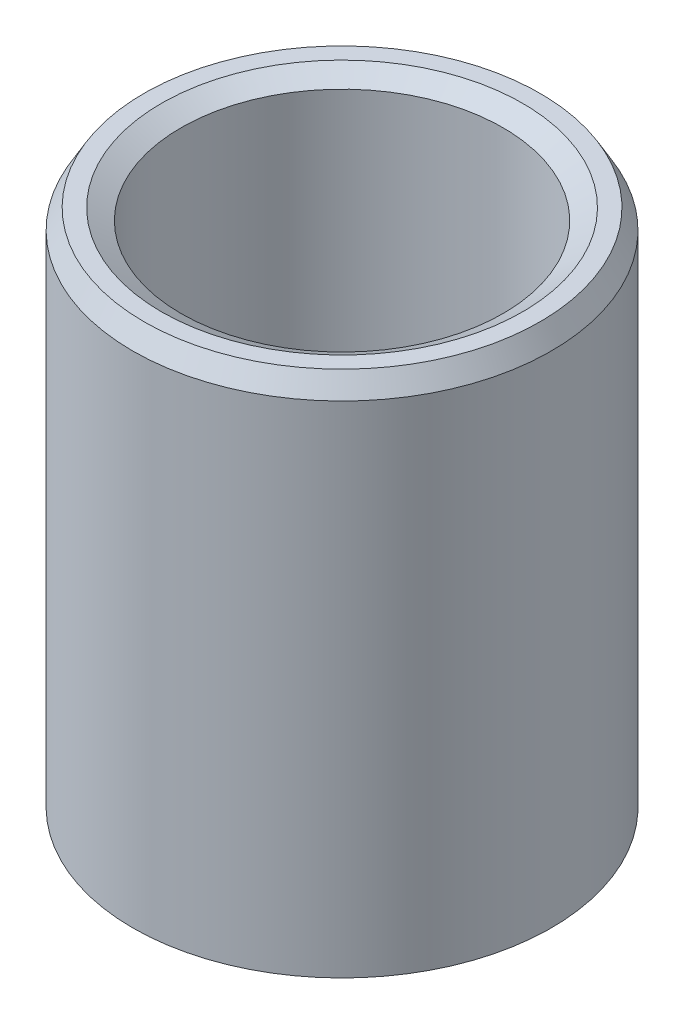
ISO-10303-21;
HEADER;
FILE_DESCRIPTION(('STEP AP214'),'2;1');
FILE_NAME('part.step','',(''),(''),'','','');
FILE_SCHEMA(('AUTOMOTIVE_DESIGN { 1 0 10303 214 1 1 1 1 }'));
ENDSEC;
DATA;
#1=APPLICATION_CONTEXT('core data for automotive mechanical design processes');
#2=APPLICATION_PROTOCOL_DEFINITION('international standard','automotive_design',2000,#1);
#3=PRODUCT_CONTEXT('',#1,'mechanical');
#4=PRODUCT('Part','Part','',(#3));
#5=PRODUCT_RELATED_PRODUCT_CATEGORY('part','',(#4));
#6=PRODUCT_DEFINITION_FORMATION('','',#4);
#7=PRODUCT_DEFINITION_CONTEXT('part definition',#1,'design');
#8=PRODUCT_DEFINITION('design','',#6,#7);
#9=PRODUCT_DEFINITION_SHAPE('','',#8);
#10=(LENGTH_UNIT() NAMED_UNIT(*) SI_UNIT(.MILLI.,.METRE.));
#11=(NAMED_UNIT(*) PLANE_ANGLE_UNIT() SI_UNIT($,.RADIAN.));
#12=(NAMED_UNIT(*) SI_UNIT($,.STERADIAN.) SOLID_ANGLE_UNIT());
#13=UNCERTAINTY_MEASURE_WITH_UNIT(LENGTH_MEASURE(1.E-05),#10,'distance_accuracy_value','');
#14=(GEOMETRIC_REPRESENTATION_CONTEXT(3) GLOBAL_UNCERTAINTY_ASSIGNED_CONTEXT((#13)) GLOBAL_UNIT_ASSIGNED_CONTEXT((#10,
#11,#12)) REPRESENTATION_CONTEXT('',''));
#15=CARTESIAN_POINT('',(0.,0.,0.));
#16=DIRECTION('',(0.,0.,1.));
#17=DIRECTION('',(1.,0.,0.));
#18=AXIS2_PLACEMENT_3D('',#15,#16,#17);
#19=CARTESIAN_POINT('',(0.,107.750585727782,0.));
#20=DIRECTION('',(0.,-1.,0.));
#21=DIRECTION('',(0.,0.,-1.));
#22=AXIS2_PLACEMENT_3D('',#19,#20,#21);
#23=CYLINDRICAL_SURFACE('',#22,42.5);
#24=CARTESIAN_POINT('',(0.,2.29921588470021,0.));
#25=DIRECTION('',(0.,1.,0.));
#26=DIRECTION('',(0.,0.,1.));
#27=AXIS2_PLACEMENT_3D('',#24,#25,#26);
#28=CIRCLE('',#27,42.5);
#29=CARTESIAN_POINT('',(0.,2.29921588470021,42.5));
#30=VERTEX_POINT('',#29);
#31=EDGE_CURVE('E10',#30,#30,#28,.T.);
#32=ORIENTED_EDGE('',*,*,#31,.T.);
#33=EDGE_LOOP('',(#32));
#34=FACE_BOUND('',#33,.T.);
#35=CARTESIAN_POINT('',(0.,103.768226997912,0.));
#36=DIRECTION('',(0.,1.,0.));
#37=DIRECTION('',(0.,0.,1.));
#38=AXIS2_PLACEMENT_3D('',#35,#36,#37);
#39=CIRCLE('',#38,42.5);
#40=CARTESIAN_POINT('',(0.,103.768226997912,42.5));
#41=VERTEX_POINT('',#40);
#42=EDGE_CURVE('E50',#41,#41,#39,.F.);
#43=ORIENTED_EDGE('',*,*,#42,.T.);
#44=EDGE_LOOP('',(#43));
#45=FACE_BOUND('',#44,.T.);
#46=ADVANCED_FACE('F39',(#34,#45),#23,.T.);
#47=CARTESIAN_POINT('',(0.,107.750585727782,0.));
#48=DIRECTION('',(0.,1.,0.));
#49=DIRECTION('',(0.,0.,1.));
#50=AXIS2_PLACEMENT_3D('',#47,#48,#49);
#51=PLANE('',#50);
#52=CARTESIAN_POINT('',(0.,107.750585727782,0.));
#53=DIRECTION('',(0.,1.,0.));
#54=DIRECTION('',(0.,0.,1.));
#55=AXIS2_PLACEMENT_3D('',#52,#53,#54);
#56=CIRCLE('',#55,36.6801592970426);
#57=CARTESIAN_POINT('',(0.,107.750585727782,36.6801592970426));
#58=VERTEX_POINT('',#57);
#59=EDGE_CURVE('E58',#58,#58,#56,.F.);
#60=ORIENTED_EDGE('',*,*,#59,.T.);
#61=EDGE_LOOP('',(#60));
#62=FACE_BOUND('',#61,.T.);
#63=CARTESIAN_POINT('',(0.,107.750585727782,0.));
#64=DIRECTION('',(0.,1.,0.));
#65=DIRECTION('',(0.,0.,1.));
#66=AXIS2_PLACEMENT_3D('',#63,#64,#65);
#67=CIRCLE('',#66,40.2007841152998);
#68=CARTESIAN_POINT('',(0.,107.750585727782,40.2007841152998));
#69=VERTEX_POINT('',#68);
#70=EDGE_CURVE('E61',#69,#69,#67,.T.);
#71=ORIENTED_EDGE('',*,*,#70,.T.);
#72=EDGE_LOOP('',(#71));
#73=FACE_BOUND('',#72,.T.);
#74=ADVANCED_FACE('F88',(#62,#73),#51,.T.);
#75=CARTESIAN_POINT('',(0.,0.,0.));
#76=DIRECTION('',(0.,1.,0.));
#77=DIRECTION('',(0.,0.,1.));
#78=AXIS2_PLACEMENT_3D('',#75,#76,#77);
#79=PLANE('',#78);
#80=CARTESIAN_POINT('',(0.,0.,0.));
#81=DIRECTION('',(0.,1.,0.));
#82=DIRECTION('',(0.,0.,1.));
#83=AXIS2_PLACEMENT_3D('',#80,#81,#82);
#84=CIRCLE('',#83,34.9970164518726);
#85=CARTESIAN_POINT('',(0.,0.,34.9970164518726));
#86=VERTEX_POINT('',#85);
#87=EDGE_CURVE('E51',#86,#86,#84,.T.);
#88=ORIENTED_EDGE('',*,*,#87,.T.);
#89=EDGE_LOOP('',(#88));
#90=FACE_BOUND('',#89,.T.);
#91=CARTESIAN_POINT('',(0.,0.,0.));
#92=DIRECTION('',(0.,1.,0.));
#93=DIRECTION('',(0.,0.,1.));
#94=AXIS2_PLACEMENT_3D('',#91,#92,#93);
#95=CIRCLE('',#94,38.5176412701298);
#96=CARTESIAN_POINT('',(0.,0.,38.5176412701298));
#97=VERTEX_POINT('',#96);
#98=EDGE_CURVE('E54',#97,#97,#95,.F.);
#99=ORIENTED_EDGE('',*,*,#98,.T.);
#100=EDGE_LOOP('',(#99));
#101=FACE_BOUND('',#100,.T.);
#102=ADVANCED_FACE('F83',(#90,#101),#79,.F.);
#103=CARTESIAN_POINT('',(0.,107.750585727782,0.));
#104=DIRECTION('',(0.,-1.,0.));
#105=DIRECTION('',(0.,0.,-1.));
#106=AXIS2_PLACEMENT_3D('',#103,#104,#105);
#107=CYLINDRICAL_SURFACE('',#106,32.6978005671725);
#108=CARTESIAN_POINT('',(0.,105.451369843082,0.));
#109=DIRECTION('',(0.,1.,0.));
#110=DIRECTION('',(0.,0.,1.));
#111=AXIS2_PLACEMENT_3D('',#108,#109,#110);
#112=CIRCLE('',#111,32.6978005671725);
#113=CARTESIAN_POINT('',(0.,105.451369843082,32.6978005671725));
#114=VERTEX_POINT('',#113);
#115=EDGE_CURVE('E67',#114,#114,#112,.T.);
#116=ORIENTED_EDGE('',*,*,#115,.T.);
#117=EDGE_LOOP('',(#116));
#118=FACE_BOUND('',#117,.T.);
#119=CARTESIAN_POINT('',(0.,3.98235872987021,0.));
#120=DIRECTION('',(0.,1.,0.));
#121=DIRECTION('',(0.,0.,1.));
#122=AXIS2_PLACEMENT_3D('',#119,#120,#121);
#123=CIRCLE('',#122,32.6978005671725);
#124=CARTESIAN_POINT('',(0.,3.98235872987021,32.6978005671725));
#125=VERTEX_POINT('',#124);
#126=EDGE_CURVE('E69',#125,#125,#123,.F.);
#127=ORIENTED_EDGE('',*,*,#126,.T.);
#128=EDGE_LOOP('',(#127));
#129=FACE_BOUND('',#128,.T.);
#130=ADVANCED_FACE('F71',(#118,#129),#107,.F.);
#131=CARTESIAN_POINT('',(0.,105.451369843082,0.));
#132=DIRECTION('',(0.,1.,0.));
#133=DIRECTION('',(0.,0.,1.));
#134=AXIS2_PLACEMENT_3D('',#131,#132,#133);
#135=CONICAL_SURFACE('',#134,32.6978005671725,1.0471975511966);
#136=ORIENTED_EDGE('',*,*,#59,.F.);
#137=EDGE_LOOP('',(#136));
#138=FACE_BOUND('',#137,.T.);
#139=ORIENTED_EDGE('',*,*,#115,.F.);
#140=EDGE_LOOP('',(#139));
#141=FACE_BOUND('',#140,.T.);
#142=ADVANCED_FACE('F77',(#138,#141),#135,.F.);
#143=CARTESIAN_POINT('',(0.,0.,0.));
#144=DIRECTION('',(0.,-1.,0.));
#145=DIRECTION('',(0.,0.,-1.));
#146=AXIS2_PLACEMENT_3D('',#143,#144,#145);
#147=CONICAL_SURFACE('',#146,34.9970164518726,0.523598775598294);
#148=ORIENTED_EDGE('',*,*,#126,.F.);
#149=EDGE_LOOP('',(#148));
#150=FACE_BOUND('',#149,.T.);
#151=ORIENTED_EDGE('',*,*,#87,.F.);
#152=EDGE_LOOP('',(#151));
#153=FACE_BOUND('',#152,.T.);
#154=ADVANCED_FACE('F73',(#150,#153),#147,.F.);
#155=CARTESIAN_POINT('',(0.,2.29921588470021,0.));
#156=DIRECTION('',(0.,1.,0.));
#157=DIRECTION('',(0.,0.,1.));
#158=AXIS2_PLACEMENT_3D('',#155,#156,#157);
#159=CONICAL_SURFACE('',#158,42.5,1.0471975511966);
#160=CARTESIAN_POINT('',(0.,0.,38.5176412701298));
#161=CARTESIAN_POINT('',(0.,0.0239501654656268,38.5591241735659));
#162=CARTESIAN_POINT('',(0.,0.0479003309312539,38.6006070770021));
#163=CARTESIAN_POINT('',(0.,0.0958006618625083,38.6835728838744));
#164=CARTESIAN_POINT('',(0.,0.119750827328135,38.7250557873105));
#165=CARTESIAN_POINT('',(0.,0.16765115825939,38.8080215941828));
#166=CARTESIAN_POINT('',(0.,0.191601323725017,38.849504497619));
#167=CARTESIAN_POINT('',(0.,0.239501654656271,38.9324703044913));
#168=CARTESIAN_POINT('',(0.,0.263451820121899,38.9739532079274));
#169=CARTESIAN_POINT('',(0.,0.311352151053153,39.0569190147997));
#170=CARTESIAN_POINT('',(0.,0.33530231651878,39.0984019182359));
#171=CARTESIAN_POINT('',(0.,0.383202647450034,39.1813677251082));
#172=CARTESIAN_POINT('',(0.,0.407152812915662,39.2228506285443));
#173=CARTESIAN_POINT('',(0.,0.455053143846916,39.3058164354166));
#174=CARTESIAN_POINT('',(0.,0.479003309312543,39.3472993388528));
#175=CARTESIAN_POINT('',(0.,0.526903640243797,39.4302651457251));
#176=CARTESIAN_POINT('',(0.,0.550853805709424,39.4717480491612));
#177=CARTESIAN_POINT('',(0.,0.598754136640679,39.5547138560335));
#178=CARTESIAN_POINT('',(0.,0.622704302106306,39.5961967594696));
#179=CARTESIAN_POINT('',(0.,0.67060463303756,39.6791625663419));
#180=CARTESIAN_POINT('',(0.,0.694554798503187,39.7206454697781));
#181=CARTESIAN_POINT('',(0.,0.742455129434442,39.8036112766504));
#182=CARTESIAN_POINT('',(0.,0.766405294900069,39.8450941800865));
#183=CARTESIAN_POINT('',(0.,0.814305625831323,39.9280599869588));
#184=CARTESIAN_POINT('',(0.,0.838255791296951,39.969542890395));
#185=CARTESIAN_POINT('',(0.,0.886156122228206,40.0525086972673));
#186=CARTESIAN_POINT('',(0.,0.910106287693833,40.0939916007034));
#187=CARTESIAN_POINT('',(0.,0.958006618625087,40.1769574075757));
#188=CARTESIAN_POINT('',(0.,0.981956784090714,40.2184403110119));
#189=CARTESIAN_POINT('',(0.,1.02985711502197,40.3014061178842));
#190=CARTESIAN_POINT('',(0.,1.0538072804876,40.3428890213203));
#191=CARTESIAN_POINT('',(0.,1.10170761141885,40.4258548281926));
#192=CARTESIAN_POINT('',(0.,1.12565777688448,40.4673377316288));
#193=CARTESIAN_POINT('',(0.,1.17355810781573,40.5503035385011));
#194=CARTESIAN_POINT('',(0.,1.19750827328136,40.5917864419372));
#195=CARTESIAN_POINT('',(0.,1.24540860421261,40.6747522488095));
#196=CARTESIAN_POINT('',(0.,1.26935876967824,40.7162351522456));
#197=CARTESIAN_POINT('',(0.,1.31725910060949,40.7992009591179));
#198=CARTESIAN_POINT('',(0.,1.34120926607512,40.8406838625541));
#199=CARTESIAN_POINT('',(0.,1.38910959700638,40.9236496694264));
#200=CARTESIAN_POINT('',(0.,1.413059762472,40.9651325728625));
#201=CARTESIAN_POINT('',(0.,1.46096009340326,41.0480983797348));
#202=CARTESIAN_POINT('',(0.,1.48491025886889,41.089581283171));
#203=CARTESIAN_POINT('',(0.,1.53281058980014,41.1725470900433));
#204=CARTESIAN_POINT('',(0.,1.55676075526577,41.2140299934794));
#205=CARTESIAN_POINT('',(0.,1.60466108619702,41.2969958003517));
#206=CARTESIAN_POINT('',(0.,1.62861125166265,41.3384787037879));
#207=CARTESIAN_POINT('',(0.,1.6765115825939,41.4214445106602));
#208=CARTESIAN_POINT('',(0.,1.70046174805953,41.4629274140963));
#209=CARTESIAN_POINT('',(0.,1.74836207899078,41.5458932209686));
#210=CARTESIAN_POINT('',(0.,1.77231224445641,41.5873761244048));
#211=CARTESIAN_POINT('',(0.,1.82021257538767,41.6703419312771));
#212=CARTESIAN_POINT('',(0.,1.84416274085329,41.7118248347132));
#213=CARTESIAN_POINT('',(0.,1.89206307178455,41.7947906415855));
#214=CARTESIAN_POINT('',(0.,1.91601323725017,41.8362735450216));
#215=CARTESIAN_POINT('',(0.,1.96391356818143,41.9192393518939));
#216=CARTESIAN_POINT('',(0.,1.98786373364706,41.9607222553301));
#217=CARTESIAN_POINT('',(0.,2.03576406457831,42.0436880622024));
#218=CARTESIAN_POINT('',(0.,2.05971423004394,42.0851709656385));
#219=CARTESIAN_POINT('',(0.,2.10761456097519,42.1681367725108));
#220=CARTESIAN_POINT('',(0.,2.13156472644082,42.209619675947));
#221=CARTESIAN_POINT('',(0.,2.17946505737207,42.2925854828193));
#222=CARTESIAN_POINT('',(0.,2.2034152228377,42.3340683862554));
#223=CARTESIAN_POINT('',(0.,2.25131555376895,42.4170341931277));
#224=CARTESIAN_POINT('',(0.,2.27526571923458,42.4585170965639));
#225=CARTESIAN_POINT('',(0.,2.29921588470021,42.5));
#226=B_SPLINE_CURVE_WITH_KNOTS('',3,(#160,#161,#162,#163,#164,#165,#166,#167,#168,#169,#170,
#171,#172,#173,#174,#175,#176,#177,#178,#179,#180,#181,#182,#183,#184,#185,#186,#187,#188,#189,
#190,#191,#192,#193,#194,#195,#196,#197,#198,#199,#200,#201,#202,#203,#204,#205,#206,#207,#208,
#209,#210,#211,#212,#213,#214,#215,#216,#217,#218,#219,#220,#221,#222,#223,#224,#225),
.UNSPECIFIED.,.F.,.F.,(4,2,2,2,2,2,2,2,2,2,2,2,2,2,2,2,2,2,2,2,2,2,2,2,2,2,2,2,2,2,2,2,4),(0.,
0.143700992793763,0.287401985587526,0.431102978381289,0.574803971175052,0.718504963968815,
0.862205956762578,1.00590694955635,1.14960794235011,1.29330893514387,1.43700992793764,
1.5807109207314,1.72441191352516,1.86811290631892,2.01181389911269,2.15551489190646,
2.29921588470022,2.44291687749398,2.58661787028775,2.73031886308151,2.87401985587527,
3.01772084866903,3.1614218414628,3.30512283425657,3.44882382705033,3.59252481984409,
3.73622581263786,3.87992680543162,4.02362779822538,4.16732879101915,4.31102978381291,
4.45473077660668,4.59843176940044),.UNSPECIFIED.);
#227=EDGE_CURVE('BSEAM76',#97,#30,#226,.T.);
#228=ORIENTED_EDGE('',*,*,#98,.F.);
#229=ORIENTED_EDGE('',*,*,#31,.F.);
#230=ORIENTED_EDGE('',*,*,#227,.T.);
#231=ORIENTED_EDGE('',*,*,#227,.F.);
#232=EDGE_LOOP('',(#228,#230,#229,#231));
#233=FACE_BOUND('',#232,.T.);
#234=ADVANCED_FACE('F76',(#233),#159,.T.);
#235=CARTESIAN_POINT('',(0.,107.750585727782,0.));
#236=DIRECTION('',(0.,-1.,0.));
#237=DIRECTION('',(0.,0.,-1.));
#238=AXIS2_PLACEMENT_3D('',#235,#236,#237);
#239=CONICAL_SURFACE('',#238,40.2007841152998,0.523598775598295);
#240=ORIENTED_EDGE('',*,*,#42,.F.);
#241=EDGE_LOOP('',(#240));
#242=FACE_BOUND('',#241,.T.);
#243=ORIENTED_EDGE('',*,*,#70,.F.);
#244=EDGE_LOOP('',(#243));
#245=FACE_BOUND('',#244,.T.);
#246=ADVANCED_FACE('F45',(#242,#245),#239,.T.);
#247=CLOSED_SHELL('',(#46,#74,#102,#130,#142,#154,#234,#246));
#248=MANIFOLD_SOLID_BREP('B2',#247);
#249=ADVANCED_BREP_SHAPE_REPRESENTATION('',(#18,#248),#14);
#250=SHAPE_DEFINITION_REPRESENTATION(#9,#249);
ENDSEC;
END-ISO-10303-21;
